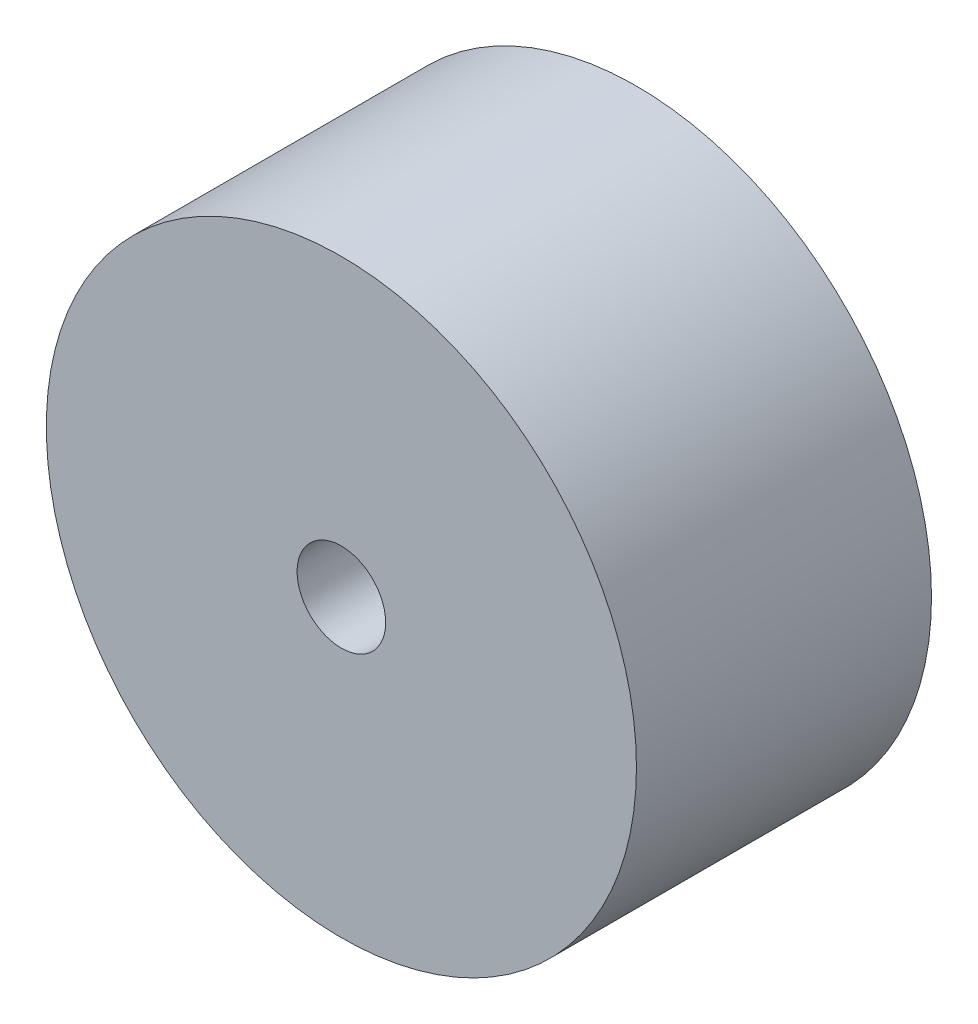
ISO-10303-21;
HEADER;
FILE_DESCRIPTION(('STEP AP214'),'2;1');
FILE_NAME('part.step','',(''),(''),'','','');
FILE_SCHEMA(('AUTOMOTIVE_DESIGN { 1 0 10303 214 1 1 1 1 }'));
ENDSEC;
DATA;
#1=APPLICATION_CONTEXT('core data for automotive mechanical design processes');
#2=APPLICATION_PROTOCOL_DEFINITION('international standard','automotive_design',2000,#1);
#3=PRODUCT_CONTEXT('',#1,'mechanical');
#4=PRODUCT('Part','Part','',(#3));
#5=PRODUCT_RELATED_PRODUCT_CATEGORY('part','',(#4));
#6=PRODUCT_DEFINITION_FORMATION('','',#4);
#7=PRODUCT_DEFINITION_CONTEXT('part definition',#1,'design');
#8=PRODUCT_DEFINITION('design','',#6,#7);
#9=PRODUCT_DEFINITION_SHAPE('','',#8);
#10=(LENGTH_UNIT() NAMED_UNIT(*) SI_UNIT(.MILLI.,.METRE.));
#11=(NAMED_UNIT(*) PLANE_ANGLE_UNIT() SI_UNIT($,.RADIAN.));
#12=(NAMED_UNIT(*) SI_UNIT($,.STERADIAN.) SOLID_ANGLE_UNIT());
#13=UNCERTAINTY_MEASURE_WITH_UNIT(LENGTH_MEASURE(1.E-05),#10,'distance_accuracy_value','');
#14=(GEOMETRIC_REPRESENTATION_CONTEXT(3) GLOBAL_UNCERTAINTY_ASSIGNED_CONTEXT((#13)) GLOBAL_UNIT_ASSIGNED_CONTEXT((#10,
#11,#12)) REPRESENTATION_CONTEXT('',''));
#15=CARTESIAN_POINT('',(0.,0.,0.));
#16=DIRECTION('',(0.,0.,1.));
#17=DIRECTION('',(1.,0.,0.));
#18=AXIS2_PLACEMENT_3D('',#15,#16,#17);
#19=CARTESIAN_POINT('',(0.,0.,10.));
#20=DIRECTION('',(0.,0.,1.));
#21=DIRECTION('',(1.,0.,0.));
#22=AXIS2_PLACEMENT_3D('',#19,#20,#21);
#23=PLANE('',#22);
#24=CARTESIAN_POINT('',(0.,0.,10.));
#25=DIRECTION('',(0.,0.,1.));
#26=DIRECTION('',(1.,0.,0.));
#27=AXIS2_PLACEMENT_3D('',#24,#25,#26);
#28=CIRCLE('',#27,10.);
#29=CARTESIAN_POINT('',(10.,0.,10.));
#30=VERTEX_POINT('',#29);
#31=EDGE_CURVE('E10',#30,#30,#28,.T.);
#32=ORIENTED_EDGE('',*,*,#31,.T.);
#33=EDGE_LOOP('',(#32));
#34=FACE_BOUND('',#33,.T.);
#35=CARTESIAN_POINT('',(0.,0.,10.));
#36=DIRECTION('',(0.,0.,1.));
#37=DIRECTION('',(1.,0.,0.));
#38=AXIS2_PLACEMENT_3D('',#35,#36,#37);
#39=CIRCLE('',#38,1.5);
#40=CARTESIAN_POINT('',(1.5,0.,10.));
#41=VERTEX_POINT('',#40);
#42=EDGE_CURVE('E40',#41,#41,#39,.T.);
#43=ORIENTED_EDGE('',*,*,#42,.F.);
#44=EDGE_LOOP('',(#43));
#45=FACE_BOUND('',#44,.T.);
#46=ADVANCED_FACE('F29',(#34,#45),#23,.T.);
#47=CARTESIAN_POINT('',(0.,0.,0.));
#48=DIRECTION('',(0.,0.,1.));
#49=DIRECTION('',(1.,0.,0.));
#50=AXIS2_PLACEMENT_3D('',#47,#48,#49);
#51=PLANE('',#50);
#52=CARTESIAN_POINT('',(0.,0.,0.));
#53=DIRECTION('',(0.,0.,1.));
#54=DIRECTION('',(1.,0.,0.));
#55=AXIS2_PLACEMENT_3D('',#52,#53,#54);
#56=CIRCLE('',#55,10.);
#57=CARTESIAN_POINT('',(10.,0.,0.));
#58=VERTEX_POINT('',#57);
#59=EDGE_CURVE('E33',#58,#58,#56,.T.);
#60=ORIENTED_EDGE('',*,*,#59,.F.);
#61=EDGE_LOOP('',(#60));
#62=FACE_BOUND('',#61,.T.);
#63=CARTESIAN_POINT('',(0.,0.,0.));
#64=DIRECTION('',(0.,0.,1.));
#65=DIRECTION('',(1.,0.,0.));
#66=AXIS2_PLACEMENT_3D('',#63,#64,#65);
#67=CIRCLE('',#66,1.5);
#68=CARTESIAN_POINT('',(1.5,0.,0.));
#69=VERTEX_POINT('',#68);
#70=EDGE_CURVE('E42',#69,#69,#67,.T.);
#71=ORIENTED_EDGE('',*,*,#70,.T.);
#72=EDGE_LOOP('',(#71));
#73=FACE_BOUND('',#72,.T.);
#74=ADVANCED_FACE('F52',(#62,#73),#51,.F.);
#75=CARTESIAN_POINT('',(0.,0.,10.));
#76=DIRECTION('',(0.,0.,-1.));
#77=DIRECTION('',(-1.,0.,0.));
#78=AXIS2_PLACEMENT_3D('',#75,#76,#77);
#79=CYLINDRICAL_SURFACE('',#78,10.);
#80=ORIENTED_EDGE('',*,*,#31,.F.);
#81=EDGE_LOOP('',(#80));
#82=FACE_BOUND('',#81,.T.);
#83=ORIENTED_EDGE('',*,*,#59,.T.);
#84=EDGE_LOOP('',(#83));
#85=FACE_BOUND('',#84,.T.);
#86=ADVANCED_FACE('F31',(#82,#85),#79,.T.);
#87=CARTESIAN_POINT('',(0.,0.,10.));
#88=DIRECTION('',(0.,0.,-1.));
#89=DIRECTION('',(-1.,0.,0.));
#90=AXIS2_PLACEMENT_3D('',#87,#88,#89);
#91=CYLINDRICAL_SURFACE('',#90,1.5);
#92=ORIENTED_EDGE('',*,*,#42,.T.);
#93=EDGE_LOOP('',(#92));
#94=FACE_BOUND('',#93,.T.);
#95=ORIENTED_EDGE('',*,*,#70,.F.);
#96=EDGE_LOOP('',(#95));
#97=FACE_BOUND('',#96,.T.);
#98=ADVANCED_FACE('F48',(#94,#97),#91,.F.);
#99=CLOSED_SHELL('',(#46,#74,#86,#98));
#100=MANIFOLD_SOLID_BREP('B2',#99);
#101=ADVANCED_BREP_SHAPE_REPRESENTATION('',(#18,#100),#14);
#102=SHAPE_DEFINITION_REPRESENTATION(#9,#101);
ENDSEC;
END-ISO-10303-21;
